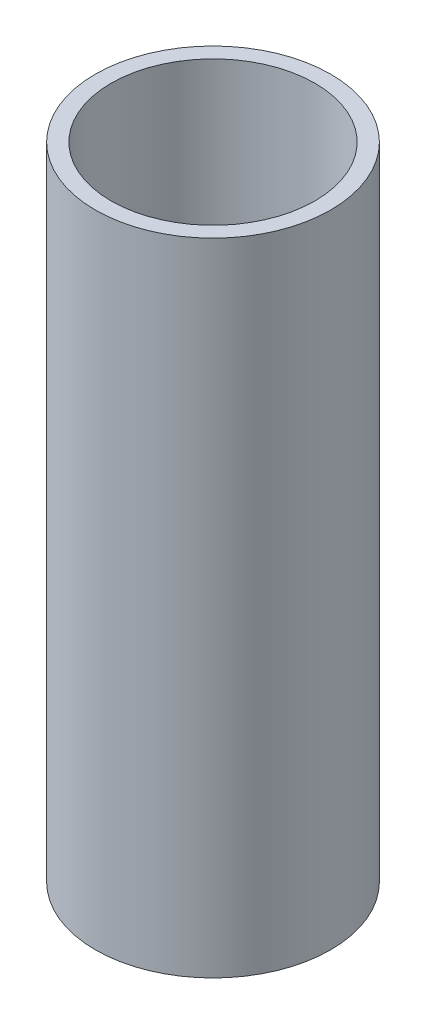
ISO-10303-21;
HEADER;
FILE_DESCRIPTION(('STEP AP214'),'2;1');
FILE_NAME('part.step','',(''),(''),'','','');
FILE_SCHEMA(('AUTOMOTIVE_DESIGN { 1 0 10303 214 1 1 1 1 }'));
ENDSEC;
DATA;
#1=APPLICATION_CONTEXT('core data for automotive mechanical design processes');
#2=APPLICATION_PROTOCOL_DEFINITION('international standard','automotive_design',2000,#1);
#3=PRODUCT_CONTEXT('',#1,'mechanical');
#4=PRODUCT('Part','Part','',(#3));
#5=PRODUCT_RELATED_PRODUCT_CATEGORY('part','',(#4));
#6=PRODUCT_DEFINITION_FORMATION('','',#4);
#7=PRODUCT_DEFINITION_CONTEXT('part definition',#1,'design');
#8=PRODUCT_DEFINITION('design','',#6,#7);
#9=PRODUCT_DEFINITION_SHAPE('','',#8);
#10=(LENGTH_UNIT() NAMED_UNIT(*) SI_UNIT(.MILLI.,.METRE.));
#11=(NAMED_UNIT(*) PLANE_ANGLE_UNIT() SI_UNIT($,.RADIAN.));
#12=(NAMED_UNIT(*) SI_UNIT($,.STERADIAN.) SOLID_ANGLE_UNIT());
#13=UNCERTAINTY_MEASURE_WITH_UNIT(LENGTH_MEASURE(1.E-05),#10,'distance_accuracy_value','');
#14=(GEOMETRIC_REPRESENTATION_CONTEXT(3) GLOBAL_UNCERTAINTY_ASSIGNED_CONTEXT((#13)) GLOBAL_UNIT_ASSIGNED_CONTEXT((#10,
#11,#12)) REPRESENTATION_CONTEXT('',''));
#15=CARTESIAN_POINT('',(0.,0.,0.));
#16=DIRECTION('',(0.,0.,1.));
#17=DIRECTION('',(1.,0.,0.));
#18=AXIS2_PLACEMENT_3D('',#15,#16,#17);
#19=CARTESIAN_POINT('',(0.,217.809320948585,0.));
#20=DIRECTION('',(0.,-1.,0.));
#21=DIRECTION('',(0.,0.,-1.));
#22=AXIS2_PLACEMENT_3D('',#19,#20,#21);
#23=CYLINDRICAL_SURFACE('',#22,40.);
#24=CARTESIAN_POINT('',(0.,217.809320948585,0.));
#25=DIRECTION('',(0.,1.,0.));
#26=DIRECTION('',(0.,0.,1.));
#27=AXIS2_PLACEMENT_3D('',#24,#25,#26);
#28=CIRCLE('',#27,40.);
#29=CARTESIAN_POINT('',(0.,217.809320948585,40.));
#30=VERTEX_POINT('',#29);
#31=EDGE_CURVE('E10',#30,#30,#28,.T.);
#32=ORIENTED_EDGE('',*,*,#31,.F.);
#33=EDGE_LOOP('',(#32));
#34=FACE_BOUND('',#33,.T.);
#35=CARTESIAN_POINT('',(0.,0.,0.));
#36=DIRECTION('',(0.,1.,0.));
#37=DIRECTION('',(0.,0.,1.));
#38=AXIS2_PLACEMENT_3D('',#35,#36,#37);
#39=CIRCLE('',#38,40.);
#40=CARTESIAN_POINT('',(0.,0.,40.));
#41=VERTEX_POINT('',#40);
#42=EDGE_CURVE('E37',#41,#41,#39,.T.);
#43=ORIENTED_EDGE('',*,*,#42,.T.);
#44=EDGE_LOOP('',(#43));
#45=FACE_BOUND('',#44,.T.);
#46=ADVANCED_FACE('F40',(#34,#45),#23,.T.);
#47=CARTESIAN_POINT('',(0.,217.809320948585,0.));
#48=DIRECTION('',(0.,1.,0.));
#49=DIRECTION('',(0.,0.,1.));
#50=AXIS2_PLACEMENT_3D('',#47,#48,#49);
#51=PLANE('',#50);
#52=CARTESIAN_POINT('',(0.,217.809320948585,0.));
#53=DIRECTION('',(0.,1.,0.));
#54=DIRECTION('',(0.,0.,1.));
#55=AXIS2_PLACEMENT_3D('',#52,#53,#54);
#56=CIRCLE('',#55,34.6521568433859);
#57=CARTESIAN_POINT('',(0.,217.809320948585,34.6521568433859));
#58=VERTEX_POINT('',#57);
#59=EDGE_CURVE('E50',#58,#58,#56,.T.);
#60=ORIENTED_EDGE('',*,*,#59,.F.);
#61=EDGE_LOOP('',(#60));
#62=FACE_BOUND('',#61,.T.);
#63=ORIENTED_EDGE('',*,*,#31,.T.);
#64=EDGE_LOOP('',(#63));
#65=FACE_BOUND('',#64,.T.);
#66=ADVANCED_FACE('F59',(#62,#65),#51,.T.);
#67=CARTESIAN_POINT('',(0.,0.,0.));
#68=DIRECTION('',(0.,1.,0.));
#69=DIRECTION('',(0.,0.,1.));
#70=AXIS2_PLACEMENT_3D('',#67,#68,#69);
#71=PLANE('',#70);
#72=CARTESIAN_POINT('',(0.,0.,0.));
#73=DIRECTION('',(0.,1.,0.));
#74=DIRECTION('',(0.,0.,1.));
#75=AXIS2_PLACEMENT_3D('',#72,#73,#74);
#76=CIRCLE('',#75,34.6521568433859);
#77=CARTESIAN_POINT('',(0.,0.,34.6521568433859));
#78=VERTEX_POINT('',#77);
#79=EDGE_CURVE('E47',#78,#78,#76,.T.);
#80=ORIENTED_EDGE('',*,*,#79,.T.);
#81=EDGE_LOOP('',(#80));
#82=FACE_BOUND('',#81,.T.);
#83=ORIENTED_EDGE('',*,*,#42,.F.);
#84=EDGE_LOOP('',(#83));
#85=FACE_BOUND('',#84,.T.);
#86=ADVANCED_FACE('F58',(#82,#85),#71,.F.);
#87=CARTESIAN_POINT('',(0.,217.809320948585,0.));
#88=DIRECTION('',(0.,-1.,0.));
#89=DIRECTION('',(0.,0.,-1.));
#90=AXIS2_PLACEMENT_3D('',#87,#88,#89);
#91=CYLINDRICAL_SURFACE('',#90,34.6521568433859);
#92=ORIENTED_EDGE('',*,*,#59,.T.);
#93=EDGE_LOOP('',(#92));
#94=FACE_BOUND('',#93,.T.);
#95=ORIENTED_EDGE('',*,*,#79,.F.);
#96=EDGE_LOOP('',(#95));
#97=FACE_BOUND('',#96,.T.);
#98=ADVANCED_FACE('F54',(#94,#97),#91,.F.);
#99=CLOSED_SHELL('',(#46,#66,#86,#98));
#100=MANIFOLD_SOLID_BREP('B2',#99);
#101=ADVANCED_BREP_SHAPE_REPRESENTATION('',(#18,#100),#14);
#102=SHAPE_DEFINITION_REPRESENTATION(#9,#101);
ENDSEC;
END-ISO-10303-21;
